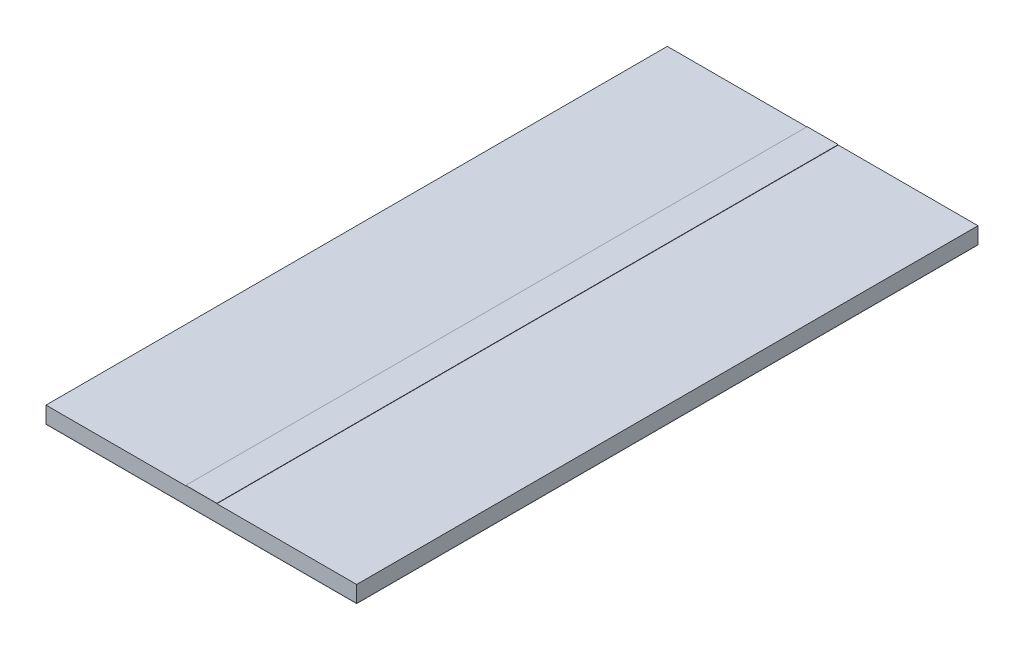
ISO-10303-21;
HEADER;
FILE_DESCRIPTION(('STEP AP214'),'2;1');
FILE_NAME('part.step','',(''),(''),'','','');
FILE_SCHEMA(('AUTOMOTIVE_DESIGN { 1 0 10303 214 1 1 1 1 }'));
ENDSEC;
DATA;
#1=APPLICATION_CONTEXT('core data for automotive mechanical design processes');
#2=APPLICATION_PROTOCOL_DEFINITION('international standard','automotive_design',2000,#1);
#3=PRODUCT_CONTEXT('',#1,'mechanical');
#4=PRODUCT('Part','Part','',(#3));
#5=PRODUCT_RELATED_PRODUCT_CATEGORY('part','',(#4));
#6=PRODUCT_DEFINITION_FORMATION('','',#4);
#7=PRODUCT_DEFINITION_CONTEXT('part definition',#1,'design');
#8=PRODUCT_DEFINITION('design','',#6,#7);
#9=PRODUCT_DEFINITION_SHAPE('','',#8);
#10=(LENGTH_UNIT() NAMED_UNIT(*) SI_UNIT(.MILLI.,.METRE.));
#11=(NAMED_UNIT(*) PLANE_ANGLE_UNIT() SI_UNIT($,.RADIAN.));
#12=(NAMED_UNIT(*) SI_UNIT($,.STERADIAN.) SOLID_ANGLE_UNIT());
#13=UNCERTAINTY_MEASURE_WITH_UNIT(LENGTH_MEASURE(1.E-05),#10,'distance_accuracy_value','');
#14=(GEOMETRIC_REPRESENTATION_CONTEXT(3) GLOBAL_UNCERTAINTY_ASSIGNED_CONTEXT((#13)) GLOBAL_UNIT_ASSIGNED_CONTEXT((#10,
#11,#12)) REPRESENTATION_CONTEXT('',''));
#15=CARTESIAN_POINT('',(0.,0.,0.));
#16=DIRECTION('',(0.,0.,1.));
#17=DIRECTION('',(1.,0.,0.));
#18=AXIS2_PLACEMENT_3D('',#15,#16,#17);
#19=CARTESIAN_POINT('',(1.5,1.64112,30.));
#20=DIRECTION('',(-1.,0.,0.));
#21=DIRECTION('',(0.,0.,1.));
#22=AXIS2_PLACEMENT_3D('',#19,#20,#21);
#23=PLANE('',#22);
#24=DIRECTION('',(0.,0.,-1.));
#25=VECTOR('',#24,1.);
#26=CARTESIAN_POINT('',(1.5,1.60556,30.));
#27=LINE('',#26,#25);
#28=CARTESIAN_POINT('',(1.5,1.60556,30.));
#29=VERTEX_POINT('',#28);
#30=CARTESIAN_POINT('',(1.5,1.60556,-30.));
#31=VERTEX_POINT('',#30);
#32=EDGE_CURVE('E109',#29,#31,#27,.T.);
#33=ORIENTED_EDGE('',*,*,#32,.T.);
#34=DIRECTION('',(0.,-1.,0.));
#35=VECTOR('',#34,1.);
#36=CARTESIAN_POINT('',(1.5,1.64112,-30.));
#37=LINE('',#36,#35);
#38=CARTESIAN_POINT('',(1.5,1.64112,-30.));
#39=VERTEX_POINT('',#38);
#40=EDGE_CURVE('E12',#39,#31,#37,.T.);
#41=ORIENTED_EDGE('',*,*,#40,.F.);
#42=DIRECTION('',(0.,0.,-1.));
#43=VECTOR('',#42,1.);
#44=CARTESIAN_POINT('',(1.5,1.64112,30.));
#45=LINE('',#44,#43);
#46=CARTESIAN_POINT('',(1.5,1.64112,30.));
#47=VERTEX_POINT('',#46);
#48=EDGE_CURVE('E97',#47,#39,#45,.T.);
#49=ORIENTED_EDGE('',*,*,#48,.F.);
#50=DIRECTION('',(0.,-1.,0.));
#51=VECTOR('',#50,1.);
#52=CARTESIAN_POINT('',(1.5,1.64112,30.));
#53=LINE('',#52,#51);
#54=EDGE_CURVE('E105',#47,#29,#53,.T.);
#55=ORIENTED_EDGE('',*,*,#54,.T.);
#56=EDGE_LOOP('',(#33,#41,#49,#55));
#57=FACE_BOUND('',#56,.T.);
#58=ADVANCED_FACE('F46',(#57),#23,.F.);
#59=CARTESIAN_POINT('',(-1.5,1.64112,-30.));
#60=DIRECTION('',(0.,0.,1.));
#61=DIRECTION('',(1.,0.,0.));
#62=AXIS2_PLACEMENT_3D('',#59,#60,#61);
#63=PLANE('',#62);
#64=DIRECTION('',(-1.,0.,0.));
#65=VECTOR('',#64,1.);
#66=CARTESIAN_POINT('',(-1.5,1.60556,-30.));
#67=LINE('',#66,#65);
#68=CARTESIAN_POINT('',(-1.5,1.60556,-30.));
#69=VERTEX_POINT('',#68);
#70=EDGE_CURVE('E101',#31,#69,#67,.T.);
#71=ORIENTED_EDGE('',*,*,#70,.T.);
#72=DIRECTION('',(0.,-1.,0.));
#73=VECTOR('',#72,1.);
#74=CARTESIAN_POINT('',(-1.5,1.64112,-30.));
#75=LINE('',#74,#73);
#76=CARTESIAN_POINT('',(-1.5,1.64112,-30.));
#77=VERTEX_POINT('',#76);
#78=EDGE_CURVE('E54',#77,#69,#75,.T.);
#79=ORIENTED_EDGE('',*,*,#78,.F.);
#80=DIRECTION('',(-1.,0.,0.));
#81=VECTOR('',#80,1.);
#82=CARTESIAN_POINT('',(-1.5,1.64112,-30.));
#83=LINE('',#82,#81);
#84=EDGE_CURVE('E92',#39,#77,#83,.T.);
#85=ORIENTED_EDGE('',*,*,#84,.F.);
#86=ORIENTED_EDGE('',*,*,#40,.T.);
#87=EDGE_LOOP('',(#71,#79,#85,#86));
#88=FACE_BOUND('',#87,.T.);
#89=ADVANCED_FACE('F100',(#88),#63,.F.);
#90=CARTESIAN_POINT('',(-1.5,1.64112,30.));
#91=DIRECTION('',(1.,0.,0.));
#92=DIRECTION('',(0.,0.,-1.));
#93=AXIS2_PLACEMENT_3D('',#90,#91,#92);
#94=PLANE('',#93);
#95=DIRECTION('',(0.,0.,1.));
#96=VECTOR('',#95,1.);
#97=CARTESIAN_POINT('',(-1.5,1.60556,30.));
#98=LINE('',#97,#96);
#99=CARTESIAN_POINT('',(-1.5,1.60556,30.));
#100=VERTEX_POINT('',#99);
#101=EDGE_CURVE('E79',#69,#100,#98,.T.);
#102=ORIENTED_EDGE('',*,*,#101,.T.);
#103=DIRECTION('',(0.,-1.,0.));
#104=VECTOR('',#103,1.);
#105=CARTESIAN_POINT('',(-1.5,1.64112,30.));
#106=LINE('',#105,#104);
#107=CARTESIAN_POINT('',(-1.5,1.64112,30.));
#108=VERTEX_POINT('',#107);
#109=EDGE_CURVE('E102',#108,#100,#106,.T.);
#110=ORIENTED_EDGE('',*,*,#109,.F.);
#111=DIRECTION('',(0.,0.,1.));
#112=VECTOR('',#111,1.);
#113=CARTESIAN_POINT('',(-1.5,1.64112,30.));
#114=LINE('',#113,#112);
#115=EDGE_CURVE('E95',#77,#108,#114,.T.);
#116=ORIENTED_EDGE('',*,*,#115,.F.);
#117=ORIENTED_EDGE('',*,*,#78,.T.);
#118=EDGE_LOOP('',(#102,#110,#116,#117));
#119=FACE_BOUND('',#118,.T.);
#120=ADVANCED_FACE('F103',(#119),#94,.F.);
#121=CARTESIAN_POINT('',(-1.5,1.64112,30.));
#122=DIRECTION('',(0.,0.,-1.));
#123=DIRECTION('',(-1.,0.,0.));
#124=AXIS2_PLACEMENT_3D('',#121,#122,#123);
#125=PLANE('',#124);
#126=DIRECTION('',(1.,0.,0.));
#127=VECTOR('',#126,1.);
#128=CARTESIAN_POINT('',(-1.5,1.60556,30.));
#129=LINE('',#128,#127);
#130=EDGE_CURVE('E85',#100,#29,#129,.T.);
#131=ORIENTED_EDGE('',*,*,#130,.T.);
#132=ORIENTED_EDGE('',*,*,#54,.F.);
#133=DIRECTION('',(1.,0.,0.));
#134=VECTOR('',#133,1.);
#135=CARTESIAN_POINT('',(-1.5,1.64112,30.));
#136=LINE('',#135,#134);
#137=EDGE_CURVE('E62',#108,#47,#136,.T.);
#138=ORIENTED_EDGE('',*,*,#137,.F.);
#139=ORIENTED_EDGE('',*,*,#109,.T.);
#140=EDGE_LOOP('',(#131,#132,#138,#139));
#141=FACE_BOUND('',#140,.T.);
#142=ADVANCED_FACE('F116',(#141),#125,.F.);
#143=CARTESIAN_POINT('',(0.,1.64112,0.));
#144=DIRECTION('',(0.,-1.,0.));
#145=DIRECTION('',(0.,0.,-1.));
#146=AXIS2_PLACEMENT_3D('',#143,#144,#145);
#147=PLANE('',#146);
#148=ORIENTED_EDGE('',*,*,#48,.T.);
#149=ORIENTED_EDGE('',*,*,#84,.T.);
#150=ORIENTED_EDGE('',*,*,#115,.T.);
#151=ORIENTED_EDGE('',*,*,#137,.T.);
#152=EDGE_LOOP('',(#148,#149,#150,#151));
#153=FACE_BOUND('',#152,.T.);
#154=ADVANCED_FACE('F93',(#153),#147,.F.);
#155=CARTESIAN_POINT('',(0.,1.60556,0.));
#156=DIRECTION('',(0.,-1.,0.));
#157=DIRECTION('',(0.,0.,-1.));
#158=AXIS2_PLACEMENT_3D('',#155,#156,#157);
#159=PLANE('',#158);
#160=ORIENTED_EDGE('',*,*,#32,.F.);
#161=ORIENTED_EDGE('',*,*,#130,.F.);
#162=ORIENTED_EDGE('',*,*,#101,.F.);
#163=ORIENTED_EDGE('',*,*,#70,.F.);
#164=EDGE_LOOP('',(#160,#161,#162,#163));
#165=FACE_BOUND('',#164,.T.);
#166=ADVANCED_FACE('F119',(#165),#159,.T.);
#167=CLOSED_SHELL('',(#58,#89,#120,#142,#154,#166));
#168=MANIFOLD_SOLID_BREP('B2',#167);
#169=CARTESIAN_POINT('',(-15.,1.60556,-30.));
#170=DIRECTION('',(1.,0.,0.));
#171=DIRECTION('',(0.,0.,-1.));
#172=AXIS2_PLACEMENT_3D('',#169,#170,#171);
#173=PLANE('',#172);
#174=DIRECTION('',(0.,0.,1.));
#175=VECTOR('',#174,1.);
#176=CARTESIAN_POINT('',(-15.,0.03556,-30.));
#177=LINE('',#176,#175);
#178=CARTESIAN_POINT('',(-15.,0.03556,-30.));
#179=VERTEX_POINT('',#178);
#180=CARTESIAN_POINT('',(-15.,0.03556,30.));
#181=VERTEX_POINT('',#180);
#182=EDGE_CURVE('E242',#179,#181,#177,.T.);
#183=ORIENTED_EDGE('',*,*,#182,.T.);
#184=DIRECTION('',(0.,-1.,0.));
#185=VECTOR('',#184,1.);
#186=CARTESIAN_POINT('',(-15.,1.60556,30.));
#187=LINE('',#186,#185);
#188=CARTESIAN_POINT('',(-15.,1.60556,30.));
#189=VERTEX_POINT('',#188);
#190=EDGE_CURVE('E44',#189,#181,#187,.T.);
#191=ORIENTED_EDGE('',*,*,#190,.F.);
#192=DIRECTION('',(0.,0.,1.));
#193=VECTOR('',#192,1.);
#194=CARTESIAN_POINT('',(-15.,1.60556,-30.));
#195=LINE('',#194,#193);
#196=CARTESIAN_POINT('',(-15.,1.60556,-30.));
#197=VERTEX_POINT('',#196);
#198=EDGE_CURVE('E230',#197,#189,#195,.T.);
#199=ORIENTED_EDGE('',*,*,#198,.F.);
#200=DIRECTION('',(0.,-1.,0.));
#201=VECTOR('',#200,1.);
#202=CARTESIAN_POINT('',(-15.,1.60556,-30.));
#203=LINE('',#202,#201);
#204=EDGE_CURVE('E238',#197,#179,#203,.T.);
#205=ORIENTED_EDGE('',*,*,#204,.T.);
#206=EDGE_LOOP('',(#183,#191,#199,#205));
#207=FACE_BOUND('',#206,.T.);
#208=ADVANCED_FACE('F179',(#207),#173,.F.);
#209=CARTESIAN_POINT('',(-15.,1.60556,30.));
#210=DIRECTION('',(0.,0.,-1.));
#211=DIRECTION('',(-1.,0.,0.));
#212=AXIS2_PLACEMENT_3D('',#209,#210,#211);
#213=PLANE('',#212);
#214=DIRECTION('',(1.,0.,0.));
#215=VECTOR('',#214,1.);
#216=CARTESIAN_POINT('',(-15.,0.03556,30.));
#217=LINE('',#216,#215);
#218=CARTESIAN_POINT('',(15.,0.03556,30.));
#219=VERTEX_POINT('',#218);
#220=EDGE_CURVE('E234',#181,#219,#217,.T.);
#221=ORIENTED_EDGE('',*,*,#220,.T.);
#222=DIRECTION('',(0.,-1.,0.));
#223=VECTOR('',#222,1.);
#224=CARTESIAN_POINT('',(15.,1.60556,30.));
#225=LINE('',#224,#223);
#226=CARTESIAN_POINT('',(15.,1.60556,30.));
#227=VERTEX_POINT('',#226);
#228=EDGE_CURVE('E187',#227,#219,#225,.T.);
#229=ORIENTED_EDGE('',*,*,#228,.F.);
#230=DIRECTION('',(1.,0.,0.));
#231=VECTOR('',#230,1.);
#232=CARTESIAN_POINT('',(-15.,1.60556,30.));
#233=LINE('',#232,#231);
#234=EDGE_CURVE('E225',#189,#227,#233,.T.);
#235=ORIENTED_EDGE('',*,*,#234,.F.);
#236=ORIENTED_EDGE('',*,*,#190,.T.);
#237=EDGE_LOOP('',(#221,#229,#235,#236));
#238=FACE_BOUND('',#237,.T.);
#239=ADVANCED_FACE('F233',(#238),#213,.F.);
#240=CARTESIAN_POINT('',(15.,1.60556,-30.));
#241=DIRECTION('',(-1.,0.,0.));
#242=DIRECTION('',(0.,0.,1.));
#243=AXIS2_PLACEMENT_3D('',#240,#241,#242);
#244=PLANE('',#243);
#245=DIRECTION('',(0.,0.,-1.));
#246=VECTOR('',#245,1.);
#247=CARTESIAN_POINT('',(15.,0.03556,-30.));
#248=LINE('',#247,#246);
#249=CARTESIAN_POINT('',(15.,0.03556,-30.));
#250=VERTEX_POINT('',#249);
#251=EDGE_CURVE('E212',#219,#250,#248,.T.);
#252=ORIENTED_EDGE('',*,*,#251,.T.);
#253=DIRECTION('',(0.,-1.,0.));
#254=VECTOR('',#253,1.);
#255=CARTESIAN_POINT('',(15.,1.60556,-30.));
#256=LINE('',#255,#254);
#257=CARTESIAN_POINT('',(15.,1.60556,-30.));
#258=VERTEX_POINT('',#257);
#259=EDGE_CURVE('E235',#258,#250,#256,.T.);
#260=ORIENTED_EDGE('',*,*,#259,.F.);
#261=DIRECTION('',(0.,0.,-1.));
#262=VECTOR('',#261,1.);
#263=CARTESIAN_POINT('',(15.,1.60556,-30.));
#264=LINE('',#263,#262);
#265=EDGE_CURVE('E228',#227,#258,#264,.T.);
#266=ORIENTED_EDGE('',*,*,#265,.F.);
#267=ORIENTED_EDGE('',*,*,#228,.T.);
#268=EDGE_LOOP('',(#252,#260,#266,#267));
#269=FACE_BOUND('',#268,.T.);
#270=ADVANCED_FACE('F236',(#269),#244,.F.);
#271=CARTESIAN_POINT('',(-15.,1.60556,-30.));
#272=DIRECTION('',(0.,0.,1.));
#273=DIRECTION('',(1.,0.,0.));
#274=AXIS2_PLACEMENT_3D('',#271,#272,#273);
#275=PLANE('',#274);
#276=DIRECTION('',(-1.,0.,0.));
#277=VECTOR('',#276,1.);
#278=CARTESIAN_POINT('',(-15.,0.03556,-30.));
#279=LINE('',#278,#277);
#280=EDGE_CURVE('E218',#250,#179,#279,.T.);
#281=ORIENTED_EDGE('',*,*,#280,.T.);
#282=ORIENTED_EDGE('',*,*,#204,.F.);
#283=DIRECTION('',(-1.,0.,0.));
#284=VECTOR('',#283,1.);
#285=CARTESIAN_POINT('',(-15.,1.60556,-30.));
#286=LINE('',#285,#284);
#287=EDGE_CURVE('E195',#258,#197,#286,.T.);
#288=ORIENTED_EDGE('',*,*,#287,.F.);
#289=ORIENTED_EDGE('',*,*,#259,.T.);
#290=EDGE_LOOP('',(#281,#282,#288,#289));
#291=FACE_BOUND('',#290,.T.);
#292=ADVANCED_FACE('F249',(#291),#275,.F.);
#293=CARTESIAN_POINT('',(0.,1.60556,0.));
#294=DIRECTION('',(0.,1.,0.));
#295=DIRECTION('',(0.,0.,1.));
#296=AXIS2_PLACEMENT_3D('',#293,#294,#295);
#297=PLANE('',#296);
#298=ORIENTED_EDGE('',*,*,#198,.T.);
#299=ORIENTED_EDGE('',*,*,#234,.T.);
#300=ORIENTED_EDGE('',*,*,#265,.T.);
#301=ORIENTED_EDGE('',*,*,#287,.T.);
#302=EDGE_LOOP('',(#298,#299,#300,#301));
#303=FACE_BOUND('',#302,.T.);
#304=ADVANCED_FACE('F226',(#303),#297,.T.);
#305=CARTESIAN_POINT('',(0.,0.03556,0.));
#306=DIRECTION('',(0.,1.,0.));
#307=DIRECTION('',(0.,0.,1.));
#308=AXIS2_PLACEMENT_3D('',#305,#306,#307);
#309=PLANE('',#308);
#310=ORIENTED_EDGE('',*,*,#182,.F.);
#311=ORIENTED_EDGE('',*,*,#280,.F.);
#312=ORIENTED_EDGE('',*,*,#251,.F.);
#313=ORIENTED_EDGE('',*,*,#220,.F.);
#314=EDGE_LOOP('',(#310,#311,#312,#313));
#315=FACE_BOUND('',#314,.T.);
#316=ADVANCED_FACE('F252',(#315),#309,.F.);
#317=CLOSED_SHELL('',(#208,#239,#270,#292,#304,#316));
#318=MANIFOLD_SOLID_BREP('B6',#317);
#319=CARTESIAN_POINT('',(15.,0.03556,30.));
#320=DIRECTION('',(-1.,0.,0.));
#321=DIRECTION('',(0.,0.,1.));
#322=AXIS2_PLACEMENT_3D('',#319,#320,#321);
#323=PLANE('',#322);
#324=DIRECTION('',(0.,0.,-1.));
#325=VECTOR('',#324,1.);
#326=CARTESIAN_POINT('',(15.,0.,30.));
#327=LINE('',#326,#325);
#328=CARTESIAN_POINT('',(15.,0.,30.));
#329=VERTEX_POINT('',#328);
#330=CARTESIAN_POINT('',(15.,0.,-30.));
#331=VERTEX_POINT('',#330);
#332=EDGE_CURVE('E366',#329,#331,#327,.T.);
#333=ORIENTED_EDGE('',*,*,#332,.T.);
#334=DIRECTION('',(0.,-1.,0.));
#335=VECTOR('',#334,1.);
#336=CARTESIAN_POINT('',(15.,0.03556,-30.));
#337=LINE('',#336,#335);
#338=CARTESIAN_POINT('',(15.,0.03556,-30.));
#339=VERTEX_POINT('',#338);
#340=EDGE_CURVE('E177',#339,#331,#337,.T.);
#341=ORIENTED_EDGE('',*,*,#340,.F.);
#342=DIRECTION('',(0.,0.,-1.));
#343=VECTOR('',#342,1.);
#344=CARTESIAN_POINT('',(15.,0.03556,30.));
#345=LINE('',#344,#343);
#346=CARTESIAN_POINT('',(15.,0.03556,30.));
#347=VERTEX_POINT('',#346);
#348=EDGE_CURVE('E354',#347,#339,#345,.T.);
#349=ORIENTED_EDGE('',*,*,#348,.F.);
#350=DIRECTION('',(0.,-1.,0.));
#351=VECTOR('',#350,1.);
#352=CARTESIAN_POINT('',(15.,0.03556,30.));
#353=LINE('',#352,#351);
#354=EDGE_CURVE('E362',#347,#329,#353,.T.);
#355=ORIENTED_EDGE('',*,*,#354,.T.);
#356=EDGE_LOOP('',(#333,#341,#349,#355));
#357=FACE_BOUND('',#356,.T.);
#358=ADVANCED_FACE('F303',(#357),#323,.F.);
#359=CARTESIAN_POINT('',(-15.,0.03556,-30.));
#360=DIRECTION('',(0.,0.,1.));
#361=DIRECTION('',(1.,0.,0.));
#362=AXIS2_PLACEMENT_3D('',#359,#360,#361);
#363=PLANE('',#362);
#364=DIRECTION('',(-1.,0.,0.));
#365=VECTOR('',#364,1.);
#366=CARTESIAN_POINT('',(-15.,0.,-30.));
#367=LINE('',#366,#365);
#368=CARTESIAN_POINT('',(-15.,0.,-30.));
#369=VERTEX_POINT('',#368);
#370=EDGE_CURVE('E358',#331,#369,#367,.T.);
#371=ORIENTED_EDGE('',*,*,#370,.T.);
#372=DIRECTION('',(0.,-1.,0.));
#373=VECTOR('',#372,1.);
#374=CARTESIAN_POINT('',(-15.,0.03556,-30.));
#375=LINE('',#374,#373);
#376=CARTESIAN_POINT('',(-15.,0.03556,-30.));
#377=VERTEX_POINT('',#376);
#378=EDGE_CURVE('E311',#377,#369,#375,.T.);
#379=ORIENTED_EDGE('',*,*,#378,.F.);
#380=DIRECTION('',(-1.,0.,0.));
#381=VECTOR('',#380,1.);
#382=CARTESIAN_POINT('',(-15.,0.03556,-30.));
#383=LINE('',#382,#381);
#384=EDGE_CURVE('E349',#339,#377,#383,.T.);
#385=ORIENTED_EDGE('',*,*,#384,.F.);
#386=ORIENTED_EDGE('',*,*,#340,.T.);
#387=EDGE_LOOP('',(#371,#379,#385,#386));
#388=FACE_BOUND('',#387,.T.);
#389=ADVANCED_FACE('F357',(#388),#363,.F.);
#390=CARTESIAN_POINT('',(-15.,0.03556,30.));
#391=DIRECTION('',(1.,0.,0.));
#392=DIRECTION('',(0.,0.,-1.));
#393=AXIS2_PLACEMENT_3D('',#390,#391,#392);
#394=PLANE('',#393);
#395=DIRECTION('',(0.,0.,1.));
#396=VECTOR('',#395,1.);
#397=CARTESIAN_POINT('',(-15.,0.,30.));
#398=LINE('',#397,#396);
#399=CARTESIAN_POINT('',(-15.,0.,30.));
#400=VERTEX_POINT('',#399);
#401=EDGE_CURVE('E336',#369,#400,#398,.T.);
#402=ORIENTED_EDGE('',*,*,#401,.T.);
#403=DIRECTION('',(0.,-1.,0.));
#404=VECTOR('',#403,1.);
#405=CARTESIAN_POINT('',(-15.,0.03556,30.));
#406=LINE('',#405,#404);
#407=CARTESIAN_POINT('',(-15.,0.03556,30.));
#408=VERTEX_POINT('',#407);
#409=EDGE_CURVE('E359',#408,#400,#406,.T.);
#410=ORIENTED_EDGE('',*,*,#409,.F.);
#411=DIRECTION('',(0.,0.,1.));
#412=VECTOR('',#411,1.);
#413=CARTESIAN_POINT('',(-15.,0.03556,30.));
#414=LINE('',#413,#412);
#415=EDGE_CURVE('E352',#377,#408,#414,.T.);
#416=ORIENTED_EDGE('',*,*,#415,.F.);
#417=ORIENTED_EDGE('',*,*,#378,.T.);
#418=EDGE_LOOP('',(#402,#410,#416,#417));
#419=FACE_BOUND('',#418,.T.);
#420=ADVANCED_FACE('F360',(#419),#394,.F.);
#421=CARTESIAN_POINT('',(-15.,0.03556,30.));
#422=DIRECTION('',(0.,0.,-1.));
#423=DIRECTION('',(-1.,0.,0.));
#424=AXIS2_PLACEMENT_3D('',#421,#422,#423);
#425=PLANE('',#424);
#426=DIRECTION('',(1.,0.,0.));
#427=VECTOR('',#426,1.);
#428=CARTESIAN_POINT('',(-15.,0.,30.));
#429=LINE('',#428,#427);
#430=EDGE_CURVE('E342',#400,#329,#429,.T.);
#431=ORIENTED_EDGE('',*,*,#430,.T.);
#432=ORIENTED_EDGE('',*,*,#354,.F.);
#433=DIRECTION('',(1.,0.,0.));
#434=VECTOR('',#433,1.);
#435=CARTESIAN_POINT('',(-15.,0.03556,30.));
#436=LINE('',#435,#434);
#437=EDGE_CURVE('E319',#408,#347,#436,.T.);
#438=ORIENTED_EDGE('',*,*,#437,.F.);
#439=ORIENTED_EDGE('',*,*,#409,.T.);
#440=EDGE_LOOP('',(#431,#432,#438,#439));
#441=FACE_BOUND('',#440,.T.);
#442=ADVANCED_FACE('F373',(#441),#425,.F.);
#443=CARTESIAN_POINT('',(0.,0.03556,0.));
#444=DIRECTION('',(0.,-1.,0.));
#445=DIRECTION('',(0.,0.,-1.));
#446=AXIS2_PLACEMENT_3D('',#443,#444,#445);
#447=PLANE('',#446);
#448=ORIENTED_EDGE('',*,*,#348,.T.);
#449=ORIENTED_EDGE('',*,*,#384,.T.);
#450=ORIENTED_EDGE('',*,*,#415,.T.);
#451=ORIENTED_EDGE('',*,*,#437,.T.);
#452=EDGE_LOOP('',(#448,#449,#450,#451));
#453=FACE_BOUND('',#452,.T.);
#454=ADVANCED_FACE('F350',(#453),#447,.F.);
#455=CARTESIAN_POINT('',(0.,0.,0.));
#456=DIRECTION('',(0.,-1.,0.));
#457=DIRECTION('',(0.,0.,-1.));
#458=AXIS2_PLACEMENT_3D('',#455,#456,#457);
#459=PLANE('',#458);
#460=ORIENTED_EDGE('',*,*,#332,.F.);
#461=ORIENTED_EDGE('',*,*,#430,.F.);
#462=ORIENTED_EDGE('',*,*,#401,.F.);
#463=ORIENTED_EDGE('',*,*,#370,.F.);
#464=EDGE_LOOP('',(#460,#461,#462,#463));
#465=FACE_BOUND('',#464,.T.);
#466=ADVANCED_FACE('F376',(#465),#459,.T.);
#467=CLOSED_SHELL('',(#358,#389,#420,#442,#454,#466));
#468=MANIFOLD_SOLID_BREP('B38',#467);
#469=ADVANCED_BREP_SHAPE_REPRESENTATION('',(#18,#168,#318,#468),#14);
#470=SHAPE_DEFINITION_REPRESENTATION(#9,#469);
ENDSEC;
END-ISO-10303-21;
